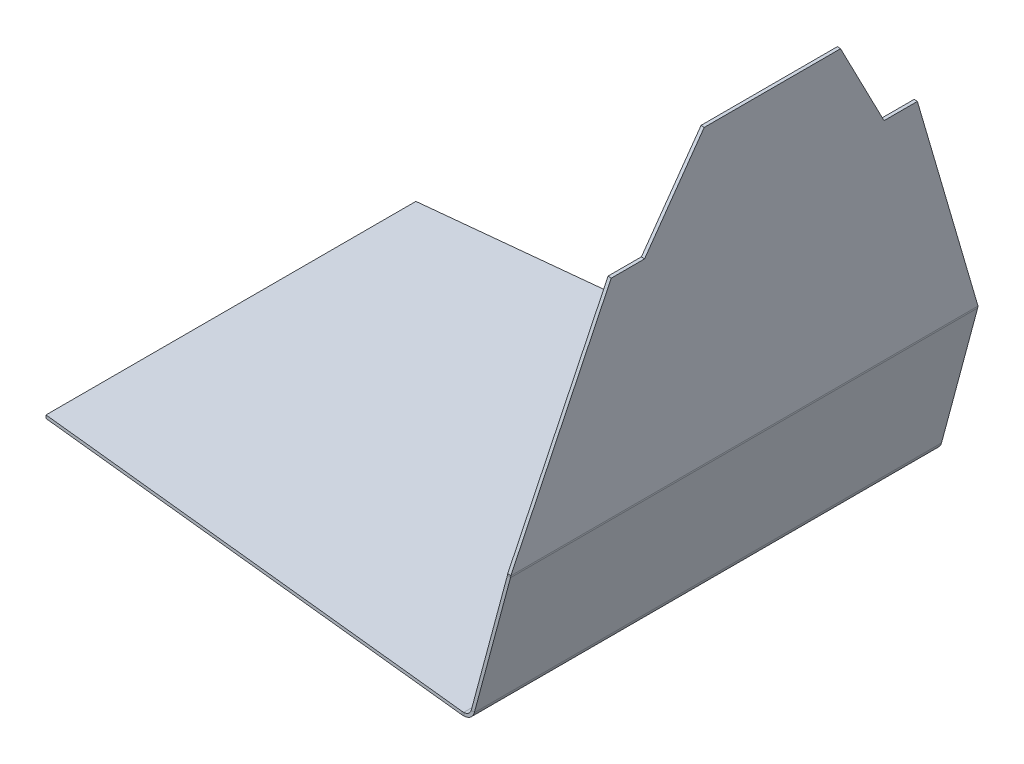
ISO-10303-21;
HEADER;
FILE_DESCRIPTION(('STEP AP214'),'2;1');
FILE_NAME('part.step','',(''),(''),'','','');
FILE_SCHEMA(('AUTOMOTIVE_DESIGN { 1 0 10303 214 1 1 1 1 }'));
ENDSEC;
DATA;
#1=APPLICATION_CONTEXT('core data for automotive mechanical design processes');
#2=APPLICATION_PROTOCOL_DEFINITION('international standard','automotive_design',2000,#1);
#3=PRODUCT_CONTEXT('',#1,'mechanical');
#4=PRODUCT('Part','Part','',(#3));
#5=PRODUCT_RELATED_PRODUCT_CATEGORY('part','',(#4));
#6=PRODUCT_DEFINITION_FORMATION('','',#4);
#7=PRODUCT_DEFINITION_CONTEXT('part definition',#1,'design');
#8=PRODUCT_DEFINITION('design','',#6,#7);
#9=PRODUCT_DEFINITION_SHAPE('','',#8);
#10=(LENGTH_UNIT() NAMED_UNIT(*) SI_UNIT(.MILLI.,.METRE.));
#11=(NAMED_UNIT(*) PLANE_ANGLE_UNIT() SI_UNIT($,.RADIAN.));
#12=(NAMED_UNIT(*) SI_UNIT($,.STERADIAN.) SOLID_ANGLE_UNIT());
#13=UNCERTAINTY_MEASURE_WITH_UNIT(LENGTH_MEASURE(1.E-05),#10,'distance_accuracy_value','');
#14=(GEOMETRIC_REPRESENTATION_CONTEXT(3) GLOBAL_UNCERTAINTY_ASSIGNED_CONTEXT((#13)) GLOBAL_UNIT_ASSIGNED_CONTEXT((#10,
#11,#12)) REPRESENTATION_CONTEXT('',''));
#15=CARTESIAN_POINT('',(0.,0.,0.));
#16=DIRECTION('',(0.,0.,1.));
#17=DIRECTION('',(1.,0.,0.));
#18=AXIS2_PLACEMENT_3D('',#15,#16,#17);
#19=CARTESIAN_POINT('',(446.934065691937,-39.1016640915989,-1.22240307231145E-13));
#20=DIRECTION('',(0.996194698091745,-0.0871557427476666,0.));
#21=DIRECTION('',(0.0871557427476666,0.996194698091745,0.));
#22=AXIS2_PLACEMENT_3D('',#19,#20,#21);
#23=PLANE('',#22);
#24=DIRECTION('',(0.,0.,-1.));
#25=VECTOR('',#24,1.);
#26=CARTESIAN_POINT('',(503.063220608211,602.45751231115,-300.));
#27=LINE('',#26,#25);
#28=CARTESIAN_POINT('',(503.063220608211,602.45751231115,87.5516477613444));
#29=VERTEX_POINT('',#28);
#30=CARTESIAN_POINT('',(503.063220608211,602.45751231115,-87.5516477613445));
#31=VERTEX_POINT('',#30);
#32=EDGE_CURVE('E209',#29,#31,#27,.T.);
#33=ORIENTED_EDGE('',*,*,#32,.F.);
#34=DIRECTION('',(-0.076110943801157,-0.869952068459671,0.487227383073281));
#35=VECTOR('',#34,1.);
#36=CARTESIAN_POINT('',(463.505302291546,150.308436963351,340.783312732004));
#37=LINE('',#36,#35);
#38=CARTESIAN_POINT('',(492.714619418007,484.172459446715,153.79865015754));
#39=VERTEX_POINT('',#38);
#40=EDGE_CURVE('E194',#29,#39,#37,.T.);
#41=ORIENTED_EDGE('',*,*,#40,.T.);
#42=DIRECTION('',(0.,0.,1.));
#43=VECTOR('',#42,1.);
#44=CARTESIAN_POINT('',(492.714619418008,484.172459446715,-1.81627154925868E-13));
#45=LINE('',#44,#43);
#46=CARTESIAN_POINT('',(492.714619418008,484.172459446715,196.591479546335));
#47=VERTEX_POINT('',#46);
#48=EDGE_CURVE('E393',#39,#47,#45,.T.);
#49=ORIENTED_EDGE('',*,*,#48,.T.);
#50=DIRECTION('',(-0.0821947035906193,-0.939489761050654,0.332570322762923));
#51=VECTOR('',#50,1.);
#52=CARTESIAN_POINT('',(457.37146331674,80.198336664604,339.594426434514));
#53=LINE('',#52,#51);
#54=CARTESIAN_POINT('',(467.157219657198,192.050043458108,300.));
#55=VERTEX_POINT('',#54);
#56=EDGE_CURVE('E396',#47,#55,#53,.T.);
#57=ORIENTED_EDGE('',*,*,#56,.T.);
#58=DIRECTION('',(0.,0.,-1.));
#59=VECTOR('',#58,1.);
#60=CARTESIAN_POINT('',(467.157219657198,192.050043458108,-2.5616833397339E-13));
#61=LINE('',#60,#59);
#62=CARTESIAN_POINT('',(467.157219657198,192.050043458108,-300.));
#63=VERTEX_POINT('',#62);
#64=EDGE_CURVE('E210',#55,#63,#61,.T.);
#65=ORIENTED_EDGE('',*,*,#64,.T.);
#66=DIRECTION('',(0.0821947035906195,0.939489761050654,0.332570322762923));
#67=VECTOR('',#66,1.);
#68=CARTESIAN_POINT('',(457.37146331674,80.1983366646043,-339.594426434515));
#69=LINE('',#68,#67);
#70=CARTESIAN_POINT('',(492.714619418007,484.172459446715,-196.591479546335));
#71=VERTEX_POINT('',#70);
#72=EDGE_CURVE('E374',#63,#71,#69,.T.);
#73=ORIENTED_EDGE('',*,*,#72,.T.);
#74=DIRECTION('',(0.,0.,1.));
#75=VECTOR('',#74,1.);
#76=CARTESIAN_POINT('',(492.714619418008,484.172459446715,-1.22240307231145E-13));
#77=LINE('',#76,#75);
#78=CARTESIAN_POINT('',(492.714619418008,484.172459446715,-153.79865015754));
#79=VERTEX_POINT('',#78);
#80=EDGE_CURVE('E378',#71,#79,#77,.T.);
#81=ORIENTED_EDGE('',*,*,#80,.T.);
#82=DIRECTION('',(0.0761109438011572,0.86995206845967,0.487227383073282));
#83=VECTOR('',#82,1.);
#84=CARTESIAN_POINT('',(463.505302291546,150.308436963352,-340.783312732004));
#85=LINE('',#84,#83);
#86=EDGE_CURVE('E381',#79,#31,#85,.T.);
#87=ORIENTED_EDGE('',*,*,#86,.T.);
#88=EDGE_LOOP('',(#33,#41,#49,#57,#65,#73,#81,#87));
#89=FACE_BOUND('',#88,.T.);
#90=ADVANCED_FACE('F59',(#89),#23,.T.);
#91=CARTESIAN_POINT('',(442.94928689957,-38.7530411206082,-1.21150435992368E-13));
#92=DIRECTION('',(0.996194698091745,-0.0871557427476666,0.));
#93=DIRECTION('',(0.0871557427476666,0.996194698091745,0.));
#94=AXIS2_PLACEMENT_3D('',#91,#92,#93);
#95=PLANE('',#94);
#96=DIRECTION('',(-0.076110943801157,-0.869952068459671,0.487227383073281));
#97=VECTOR('',#96,1.);
#98=CARTESIAN_POINT('',(459.520523499179,150.657059934342,340.783312732004));
#99=LINE('',#98,#97);
#100=CARTESIAN_POINT('',(499.078441815844,602.806135282141,87.5516477613445));
#101=VERTEX_POINT('',#100);
#102=CARTESIAN_POINT('',(488.729840625641,484.521082417706,153.79865015754));
#103=VERTEX_POINT('',#102);
#104=EDGE_CURVE('E191',#101,#103,#99,.T.);
#105=ORIENTED_EDGE('',*,*,#104,.F.);
#106=DIRECTION('',(0.,0.,-1.));
#107=VECTOR('',#106,1.);
#108=CARTESIAN_POINT('',(499.078441815844,602.80613528214,-300.));
#109=LINE('',#108,#107);
#110=CARTESIAN_POINT('',(499.078441815844,602.80613528214,-87.5516477613445));
#111=VERTEX_POINT('',#110);
#112=EDGE_CURVE('E75',#101,#111,#109,.T.);
#113=ORIENTED_EDGE('',*,*,#112,.T.);
#114=DIRECTION('',(0.0761109438011572,0.86995206845967,0.487227383073282));
#115=VECTOR('',#114,1.);
#116=CARTESIAN_POINT('',(459.520523499179,150.657059934342,-340.783312732004));
#117=LINE('',#116,#115);
#118=CARTESIAN_POINT('',(488.729840625641,484.521082417706,-153.79865015754));
#119=VERTEX_POINT('',#118);
#120=EDGE_CURVE('E377',#119,#111,#117,.T.);
#121=ORIENTED_EDGE('',*,*,#120,.F.);
#122=DIRECTION('',(0.,0.,1.));
#123=VECTOR('',#122,1.);
#124=CARTESIAN_POINT('',(488.729840625641,484.521082417706,-1.21150435992368E-13));
#125=LINE('',#124,#123);
#126=CARTESIAN_POINT('',(488.729840625641,484.521082417706,-196.591479546335));
#127=VERTEX_POINT('',#126);
#128=EDGE_CURVE('E384',#127,#119,#125,.T.);
#129=ORIENTED_EDGE('',*,*,#128,.F.);
#130=DIRECTION('',(0.0821947035906195,0.939489761050654,0.332570322762923));
#131=VECTOR('',#130,1.);
#132=CARTESIAN_POINT('',(453.386684524373,80.5469596355949,-339.594426434515));
#133=LINE('',#132,#131);
#134=CARTESIAN_POINT('',(463.172440864831,192.398666429099,-300.));
#135=VERTEX_POINT('',#134);
#136=EDGE_CURVE('E370',#135,#127,#133,.T.);
#137=ORIENTED_EDGE('',*,*,#136,.F.);
#138=DIRECTION('',(0.,0.,-1.));
#139=VECTOR('',#138,1.);
#140=CARTESIAN_POINT('',(463.172440864831,192.398666429099,300.));
#141=LINE('',#140,#139);
#142=CARTESIAN_POINT('',(463.172440864831,192.398666429099,300.));
#143=VERTEX_POINT('',#142);
#144=EDGE_CURVE('E359',#143,#135,#141,.T.);
#145=ORIENTED_EDGE('',*,*,#144,.F.);
#146=DIRECTION('',(-0.0821947035906193,-0.939489761050654,0.332570322762923));
#147=VECTOR('',#146,1.);
#148=CARTESIAN_POINT('',(453.386684524373,80.5469596355947,339.594426434514));
#149=LINE('',#148,#147);
#150=CARTESIAN_POINT('',(488.729840625641,484.521082417706,196.591479546335));
#151=VERTEX_POINT('',#150);
#152=EDGE_CURVE('E392',#151,#143,#149,.T.);
#153=ORIENTED_EDGE('',*,*,#152,.F.);
#154=DIRECTION('',(0.,0.,1.));
#155=VECTOR('',#154,1.);
#156=CARTESIAN_POINT('',(488.729840625641,484.521082417706,-1.21150435992368E-13));
#157=LINE('',#156,#155);
#158=EDGE_CURVE('E203',#103,#151,#157,.T.);
#159=ORIENTED_EDGE('',*,*,#158,.F.);
#160=EDGE_LOOP('',(#105,#113,#121,#129,#137,#145,#153,#159));
#161=FACE_BOUND('',#160,.T.);
#162=ADVANCED_FACE('F201',(#161),#95,.F.);
#163=CARTESIAN_POINT('',(503.063220608211,602.45751231115,-300.));
#164=DIRECTION('',(0.0871557427476667,0.996194698091745,0.));
#165=DIRECTION('',(-0.996194698091745,0.0871557427476667,0.));
#166=AXIS2_PLACEMENT_3D('',#163,#164,#165);
#167=PLANE('',#166);
#168=ORIENTED_EDGE('',*,*,#112,.F.);
#169=DIRECTION('',(0.996194698091745,-0.0871557427476666,0.));
#170=VECTOR('',#169,1.);
#171=CARTESIAN_POINT('',(503.063220608211,602.45751231115,87.5516477613444));
#172=LINE('',#171,#170);
#173=EDGE_CURVE('E188',#29,#101,#172,.F.);
#174=ORIENTED_EDGE('',*,*,#173,.F.);
#175=ORIENTED_EDGE('',*,*,#32,.T.);
#176=DIRECTION('',(0.996194698091745,-0.0871557427476666,0.));
#177=VECTOR('',#176,1.);
#178=CARTESIAN_POINT('',(503.063220608211,602.45751231115,-87.5516477613445));
#179=LINE('',#178,#177);
#180=EDGE_CURVE('E208',#31,#111,#179,.F.);
#181=ORIENTED_EDGE('',*,*,#180,.T.);
#182=EDGE_LOOP('',(#168,#174,#175,#181));
#183=FACE_BOUND('',#182,.T.);
#184=ADVANCED_FACE('F206',(#183),#167,.T.);
#185=CARTESIAN_POINT('',(466.959892775471,190.491832821212,-300.));
#186=DIRECTION('',(0.,0.,1.));
#187=DIRECTION('',(1.,0.,0.));
#188=AXIS2_PLACEMENT_3D('',#185,#186,#187);
#189=PLANE('',#188);
#190=DIRECTION('',(0.965925826289072,-0.258819045102507,0.));
#191=VECTOR('',#190,1.);
#192=CARTESIAN_POINT('',(462.869752146806,190.682033405549,-300.));
#193=LINE('',#192,#191);
#194=CARTESIAN_POINT('',(462.869752146804,190.68203340555,-300.));
#195=VERTEX_POINT('',#194);
#196=CARTESIAN_POINT('',(466.733455451962,189.646757225139,-300.));
#197=VERTEX_POINT('',#196);
#198=EDGE_CURVE('E224',#195,#197,#193,.T.);
#199=ORIENTED_EDGE('',*,*,#198,.T.);
#200=DIRECTION('',(0.258819045102524,0.965925826289067,0.));
#201=VECTOR('',#200,1.);
#202=CARTESIAN_POINT('',(388.726426009517,-101.479440001577,-300.));
#203=LINE('',#202,#201);
#204=CARTESIAN_POINT('',(420.30583889723,16.3765333685647,-300.));
#205=VERTEX_POINT('',#204);
#206=EDGE_CURVE('E242',#205,#197,#203,.T.);
#207=ORIENTED_EDGE('',*,*,#206,.F.);
#208=DIRECTION('',(-0.965925826289068,0.258819045102524,0.));
#209=VECTOR('',#208,1.);
#210=CARTESIAN_POINT('',(416.442135592074,17.4118095489749,-300.));
#211=LINE('',#210,#209);
#212=CARTESIAN_POINT('',(416.442135592074,17.4118095489748,-300.));
#213=VERTEX_POINT('',#212);
#214=EDGE_CURVE('E251',#213,#205,#211,.F.);
#215=ORIENTED_EDGE('',*,*,#214,.F.);
#216=DIRECTION('',(-0.258819045102524,-0.965925826289067,0.));
#217=VECTOR('',#216,1.);
#218=CARTESIAN_POINT('',(463.096189470315,191.527109001622,-300.));
#219=LINE('',#218,#217);
#220=EDGE_CURVE('E246',#213,#195,#219,.F.);
#221=ORIENTED_EDGE('',*,*,#220,.T.);
#222=EDGE_LOOP('',(#199,#207,#215,#221));
#223=FACE_BOUND('',#222,.T.);
#224=ADVANCED_FACE('F346',(#223),#189,.F.);
#225=CARTESIAN_POINT('',(418.319850514129,8.9647238195899,300.));
#226=DIRECTION('',(0.,0.,-1.));
#227=DIRECTION('',(-1.,0.,0.));
#228=AXIS2_PLACEMENT_3D('',#225,#226,#227);
#229=PLANE('',#228);
#230=DIRECTION('',(0.965925826289072,-0.258819045102507,0.));
#231=VECTOR('',#230,1.);
#232=CARTESIAN_POINT('',(462.869752146804,190.68203340555,300.));
#233=LINE('',#232,#231);
#234=CARTESIAN_POINT('',(462.869752146804,190.68203340555,300.));
#235=VERTEX_POINT('',#234);
#236=CARTESIAN_POINT('',(466.73345545196,189.64675722514,300.));
#237=VERTEX_POINT('',#236);
#238=EDGE_CURVE('E233',#235,#237,#233,.T.);
#239=ORIENTED_EDGE('',*,*,#238,.F.);
#240=DIRECTION('',(0.258819045102524,0.965925826289067,0.));
#241=VECTOR('',#240,1.);
#242=CARTESIAN_POINT('',(414.456147208973,9.99999999999998,300.));
#243=LINE('',#242,#241);
#244=CARTESIAN_POINT('',(416.442135592074,17.4118095489747,300.));
#245=VERTEX_POINT('',#244);
#246=EDGE_CURVE('E244',#235,#245,#243,.F.);
#247=ORIENTED_EDGE('',*,*,#246,.T.);
#248=DIRECTION('',(-0.965925826289068,0.258819045102524,0.));
#249=VECTOR('',#248,1.);
#250=CARTESIAN_POINT('',(420.305838897231,16.3765333685647,300.));
#251=LINE('',#250,#249);
#252=CARTESIAN_POINT('',(420.305838897231,16.3765333685646,300.));
#253=VERTEX_POINT('',#252);
#254=EDGE_CURVE('E236',#245,#253,#251,.F.);
#255=ORIENTED_EDGE('',*,*,#254,.T.);
#256=DIRECTION('',(-0.258819045102524,-0.965925826289067,0.));
#257=VECTOR('',#256,1.);
#258=CARTESIAN_POINT('',(388.726426009517,-101.479440001577,300.));
#259=LINE('',#258,#257);
#260=EDGE_CURVE('E239',#237,#253,#259,.T.);
#261=ORIENTED_EDGE('',*,*,#260,.F.);
#262=EDGE_LOOP('',(#239,#247,#255,#261));
#263=FACE_BOUND('',#262,.T.);
#264=ADVANCED_FACE('F449',(#263),#229,.F.);
#265=CARTESIAN_POINT('',(388.726426009517,-101.479440001577,-1.10216495095742E-13));
#266=DIRECTION('',(-0.965925826289068,0.258819045102524,0.));
#267=DIRECTION('',(-0.258819045102524,-0.965925826289067,0.));
#268=AXIS2_PLACEMENT_3D('',#265,#266,#267);
#269=PLANE('',#268);
#270=DIRECTION('',(0.,0.,-1.));
#271=VECTOR('',#270,1.);
#272=CARTESIAN_POINT('',(466.733455451962,189.646757225139,-300.));
#273=LINE('',#272,#271);
#274=EDGE_CURVE('E218',#197,#237,#273,.F.);
#275=ORIENTED_EDGE('',*,*,#274,.T.);
#276=ORIENTED_EDGE('',*,*,#260,.T.);
#277=DIRECTION('',(0.,0.,-1.));
#278=VECTOR('',#277,1.);
#279=CARTESIAN_POINT('',(420.305838897231,16.3765333685646,300.));
#280=LINE('',#279,#278);
#281=EDGE_CURVE('E248',#205,#253,#280,.F.);
#282=ORIENTED_EDGE('',*,*,#281,.F.);
#283=ORIENTED_EDGE('',*,*,#206,.T.);
#284=EDGE_LOOP('',(#275,#276,#282,#283));
#285=FACE_BOUND('',#284,.T.);
#286=ADVANCED_FACE('F446',(#285),#269,.F.);
#287=CARTESIAN_POINT('',(384.86272270436,-100.444163821167,-1.09144102003316E-13));
#288=DIRECTION('',(-0.965925826289068,0.258819045102524,0.));
#289=DIRECTION('',(-0.258819045102524,-0.965925826289067,0.));
#290=AXIS2_PLACEMENT_3D('',#287,#288,#289);
#291=PLANE('',#290);
#292=ORIENTED_EDGE('',*,*,#246,.F.);
#293=DIRECTION('',(0.,0.,-1.));
#294=VECTOR('',#293,1.);
#295=CARTESIAN_POINT('',(462.869752146806,190.682033405549,-300.));
#296=LINE('',#295,#294);
#297=EDGE_CURVE('E83',#195,#235,#296,.F.);
#298=ORIENTED_EDGE('',*,*,#297,.F.);
#299=ORIENTED_EDGE('',*,*,#220,.F.);
#300=DIRECTION('',(0.,0.,-1.));
#301=VECTOR('',#300,1.);
#302=CARTESIAN_POINT('',(416.442135592074,17.4118095489747,300.));
#303=LINE('',#302,#301);
#304=EDGE_CURVE('E254',#245,#213,#303,.T.);
#305=ORIENTED_EDGE('',*,*,#304,.F.);
#306=EDGE_LOOP('',(#292,#298,#299,#305));
#307=FACE_BOUND('',#306,.T.);
#308=ADVANCED_FACE('F342',(#307),#291,.T.);
#309=CARTESIAN_POINT('',(-192.279765905027,10.,-237.5));
#310=DIRECTION('',(0.104166666666667,0.,0.994559855190001));
#311=DIRECTION('',(-0.994559855190001,0.,0.104166666666667));
#312=AXIS2_PLACEMENT_3D('',#309,#310,#311);
#313=PLANE('',#312);
#314=DIRECTION('',(0.,1.,0.));
#315=VECTOR('',#314,1.);
#316=CARTESIAN_POINT('',(404.456147208973,10.,-300.));
#317=LINE('',#316,#315);
#318=CARTESIAN_POINT('',(404.456147208973,6.00000000000001,-300.));
#319=VERTEX_POINT('',#318);
#320=CARTESIAN_POINT('',(404.456147208973,10.,-300.));
#321=VERTEX_POINT('',#320);
#322=EDGE_CURVE('E68',#319,#321,#317,.T.);
#323=ORIENTED_EDGE('',*,*,#322,.F.);
#324=DIRECTION('',(-0.994559855190001,0.,0.104166666666667));
#325=VECTOR('',#324,1.);
#326=CARTESIAN_POINT('',(-192.279765905027,6.,-237.5));
#327=LINE('',#326,#325);
#328=CARTESIAN_POINT('',(-192.279765905027,6.,-237.5));
#329=VERTEX_POINT('',#328);
#330=EDGE_CURVE('E294',#319,#329,#327,.T.);
#331=ORIENTED_EDGE('',*,*,#330,.T.);
#332=DIRECTION('',(0.,1.,0.));
#333=VECTOR('',#332,1.);
#334=CARTESIAN_POINT('',(-192.279765905027,10.,-237.5));
#335=LINE('',#334,#333);
#336=CARTESIAN_POINT('',(-192.279765905027,10.,-237.5));
#337=VERTEX_POINT('',#336);
#338=EDGE_CURVE('E307',#329,#337,#335,.T.);
#339=ORIENTED_EDGE('',*,*,#338,.T.);
#340=DIRECTION('',(-0.994559855190001,0.,0.104166666666667));
#341=VECTOR('',#340,1.);
#342=CARTESIAN_POINT('',(-192.279765905027,10.,-237.5));
#343=LINE('',#342,#341);
#344=EDGE_CURVE('E297',#321,#337,#343,.T.);
#345=ORIENTED_EDGE('',*,*,#344,.F.);
#346=EDGE_LOOP('',(#323,#331,#339,#345));
#347=FACE_BOUND('',#346,.T.);
#348=ADVANCED_FACE('F321',(#347),#313,.F.);
#349=CARTESIAN_POINT('',(-192.279765905027,10.,237.5));
#350=DIRECTION('',(1.,0.,0.));
#351=DIRECTION('',(0.,0.,1.));
#352=AXIS2_PLACEMENT_3D('',#349,#350,#351);
#353=PLANE('',#352);
#354=ORIENTED_EDGE('',*,*,#338,.F.);
#355=DIRECTION('',(0.,0.,-1.));
#356=VECTOR('',#355,1.);
#357=CARTESIAN_POINT('',(-192.279765905027,6.,0.));
#358=LINE('',#357,#356);
#359=CARTESIAN_POINT('',(-192.279765905027,6.,237.5));
#360=VERTEX_POINT('',#359);
#361=EDGE_CURVE('E288',#329,#360,#358,.F.);
#362=ORIENTED_EDGE('',*,*,#361,.T.);
#363=DIRECTION('',(0.,1.,0.));
#364=VECTOR('',#363,1.);
#365=CARTESIAN_POINT('',(-192.279765905027,10.,237.5));
#366=LINE('',#365,#364);
#367=CARTESIAN_POINT('',(-192.279765905027,10.,237.5));
#368=VERTEX_POINT('',#367);
#369=EDGE_CURVE('E63',#360,#368,#366,.T.);
#370=ORIENTED_EDGE('',*,*,#369,.T.);
#371=DIRECTION('',(0.,0.,1.));
#372=VECTOR('',#371,1.);
#373=CARTESIAN_POINT('',(-192.279765905027,10.,237.5));
#374=LINE('',#373,#372);
#375=EDGE_CURVE('E290',#337,#368,#374,.T.);
#376=ORIENTED_EDGE('',*,*,#375,.F.);
#377=EDGE_LOOP('',(#354,#362,#370,#376));
#378=FACE_BOUND('',#377,.T.);
#379=ADVANCED_FACE('F325',(#378),#353,.F.);
#380=CARTESIAN_POINT('',(404.456147208973,10.,300.));
#381=DIRECTION('',(0.104166666666667,0.,-0.994559855190001));
#382=DIRECTION('',(0.994559855190001,0.,0.104166666666667));
#383=AXIS2_PLACEMENT_3D('',#380,#381,#382);
#384=PLANE('',#383);
#385=DIRECTION('',(0.994559855190001,0.,0.104166666666667));
#386=VECTOR('',#385,1.);
#387=CARTESIAN_POINT('',(404.456147208973,6.,300.));
#388=LINE('',#387,#386);
#389=CARTESIAN_POINT('',(404.456147208973,5.99999999999991,300.));
#390=VERTEX_POINT('',#389);
#391=EDGE_CURVE('E302',#360,#390,#388,.T.);
#392=ORIENTED_EDGE('',*,*,#391,.T.);
#393=DIRECTION('',(0.,1.,0.));
#394=VECTOR('',#393,1.);
#395=CARTESIAN_POINT('',(404.456147208973,10.,300.));
#396=LINE('',#395,#394);
#397=CARTESIAN_POINT('',(404.456147208973,9.99999999999991,300.));
#398=VERTEX_POINT('',#397);
#399=EDGE_CURVE('E13',#390,#398,#396,.T.);
#400=ORIENTED_EDGE('',*,*,#399,.T.);
#401=DIRECTION('',(0.994559855190001,0.,0.104166666666667));
#402=VECTOR('',#401,1.);
#403=CARTESIAN_POINT('',(404.456147208973,10.,300.));
#404=LINE('',#403,#402);
#405=EDGE_CURVE('E293',#368,#398,#404,.T.);
#406=ORIENTED_EDGE('',*,*,#405,.F.);
#407=ORIENTED_EDGE('',*,*,#369,.F.);
#408=EDGE_LOOP('',(#392,#400,#406,#407));
#409=FACE_BOUND('',#408,.T.);
#410=ADVANCED_FACE('F61',(#409),#384,.F.);
#411=CARTESIAN_POINT('',(0.,10.,0.));
#412=DIRECTION('',(0.,-1.,0.));
#413=DIRECTION('',(0.,0.,-1.));
#414=AXIS2_PLACEMENT_3D('',#411,#412,#413);
#415=PLANE('',#414);
#416=ORIENTED_EDGE('',*,*,#375,.T.);
#417=ORIENTED_EDGE('',*,*,#405,.T.);
#418=DIRECTION('',(-1.,0.,0.));
#419=VECTOR('',#418,1.);
#420=CARTESIAN_POINT('',(406.782877329183,9.9999999999999,300.));
#421=LINE('',#420,#419);
#422=CARTESIAN_POINT('',(406.782877329183,9.9999999999999,300.));
#423=VERTEX_POINT('',#422);
#424=EDGE_CURVE('E278',#423,#398,#421,.T.);
#425=ORIENTED_EDGE('',*,*,#424,.F.);
#426=DIRECTION('',(0.,0.,-1.));
#427=VECTOR('',#426,1.);
#428=CARTESIAN_POINT('',(406.782877329183,10.,-300.));
#429=LINE('',#428,#427);
#430=CARTESIAN_POINT('',(406.782877329183,10.,-300.));
#431=VERTEX_POINT('',#430);
#432=EDGE_CURVE('E271',#431,#423,#429,.F.);
#433=ORIENTED_EDGE('',*,*,#432,.F.);
#434=DIRECTION('',(-1.,0.,0.));
#435=VECTOR('',#434,1.);
#436=CARTESIAN_POINT('',(406.782877329183,10.,-300.));
#437=LINE('',#436,#435);
#438=EDGE_CURVE('E285',#431,#321,#437,.T.);
#439=ORIENTED_EDGE('',*,*,#438,.T.);
#440=ORIENTED_EDGE('',*,*,#344,.T.);
#441=EDGE_LOOP('',(#416,#417,#425,#433,#439,#440));
#442=FACE_BOUND('',#441,.T.);
#443=ADVANCED_FACE('F319',(#442),#415,.F.);
#444=CARTESIAN_POINT('',(0.,6.,0.));
#445=DIRECTION('',(0.,-1.,0.));
#446=DIRECTION('',(0.,0.,-1.));
#447=AXIS2_PLACEMENT_3D('',#444,#445,#446);
#448=PLANE('',#447);
#449=ORIENTED_EDGE('',*,*,#361,.F.);
#450=ORIENTED_EDGE('',*,*,#330,.F.);
#451=DIRECTION('',(-1.,0.,0.));
#452=VECTOR('',#451,1.);
#453=CARTESIAN_POINT('',(406.782877329183,6.,-300.));
#454=LINE('',#453,#452);
#455=CARTESIAN_POINT('',(406.782877329183,6.,-300.));
#456=VERTEX_POINT('',#455);
#457=EDGE_CURVE('E283',#456,#319,#454,.T.);
#458=ORIENTED_EDGE('',*,*,#457,.F.);
#459=DIRECTION('',(0.,0.,-1.));
#460=VECTOR('',#459,1.);
#461=CARTESIAN_POINT('',(406.782877329183,6.,-300.));
#462=LINE('',#461,#460);
#463=CARTESIAN_POINT('',(406.782877329183,5.9999999999999,300.));
#464=VERTEX_POINT('',#463);
#465=EDGE_CURVE('E258',#456,#464,#462,.F.);
#466=ORIENTED_EDGE('',*,*,#465,.T.);
#467=DIRECTION('',(-1.,0.,0.));
#468=VECTOR('',#467,1.);
#469=CARTESIAN_POINT('',(406.782877329183,5.9999999999999,300.));
#470=LINE('',#469,#468);
#471=EDGE_CURVE('E281',#464,#390,#470,.T.);
#472=ORIENTED_EDGE('',*,*,#471,.T.);
#473=ORIENTED_EDGE('',*,*,#391,.F.);
#474=EDGE_LOOP('',(#449,#450,#458,#466,#472,#473));
#475=FACE_BOUND('',#474,.T.);
#476=ADVANCED_FACE('F474',(#475),#448,.T.);
#477=CARTESIAN_POINT('',(406.782877329183,10.,-300.));
#478=DIRECTION('',(0.,0.,-1.));
#479=DIRECTION('',(0.,-1.,0.));
#480=AXIS2_PLACEMENT_3D('',#477,#478,#479);
#481=PLANE('',#480);
#482=ORIENTED_EDGE('',*,*,#438,.F.);
#483=DIRECTION('',(0.,-1.,0.));
#484=VECTOR('',#483,1.);
#485=CARTESIAN_POINT('',(406.782877329183,10.,-300.));
#486=LINE('',#485,#484);
#487=EDGE_CURVE('E265',#431,#456,#486,.T.);
#488=ORIENTED_EDGE('',*,*,#487,.T.);
#489=ORIENTED_EDGE('',*,*,#457,.T.);
#490=ORIENTED_EDGE('',*,*,#322,.T.);
#491=EDGE_LOOP('',(#482,#488,#489,#490));
#492=FACE_BOUND('',#491,.T.);
#493=ADVANCED_FACE('F312',(#492),#481,.T.);
#494=CARTESIAN_POINT('',(406.782877329183,9.9999999999999,300.));
#495=DIRECTION('',(0.,0.,-1.));
#496=DIRECTION('',(0.,-1.,0.));
#497=AXIS2_PLACEMENT_3D('',#494,#495,#496);
#498=PLANE('',#497);
#499=ORIENTED_EDGE('',*,*,#471,.F.);
#500=DIRECTION('',(0.,-1.,0.));
#501=VECTOR('',#500,1.);
#502=CARTESIAN_POINT('',(406.782877329183,9.9999999999999,300.));
#503=LINE('',#502,#501);
#504=EDGE_CURVE('E275',#423,#464,#503,.T.);
#505=ORIENTED_EDGE('',*,*,#504,.F.);
#506=ORIENTED_EDGE('',*,*,#424,.T.);
#507=ORIENTED_EDGE('',*,*,#399,.F.);
#508=EDGE_LOOP('',(#499,#505,#506,#507));
#509=FACE_BOUND('',#508,.T.);
#510=ADVANCED_FACE('F332',(#509),#498,.F.);
#511=CARTESIAN_POINT('',(406.782877329184,20.,300.));
#512=DIRECTION('',(0.,0.,1.));
#513=DIRECTION('',(0.,-1.,0.));
#514=AXIS2_PLACEMENT_3D('',#511,#512,#513);
#515=PLANE('',#514);
#516=ORIENTED_EDGE('',*,*,#254,.F.);
#517=CARTESIAN_POINT('',(406.782877329184,20.,300.));
#518=DIRECTION('',(0.,0.,-1.));
#519=DIRECTION('',(0.,1.,0.));
#520=AXIS2_PLACEMENT_3D('',#517,#518,#519);
#521=CIRCLE('',#520,10.0000000000001);
#522=EDGE_CURVE('E268',#423,#245,#521,.F.);
#523=ORIENTED_EDGE('',*,*,#522,.F.);
#524=ORIENTED_EDGE('',*,*,#504,.T.);
#525=CARTESIAN_POINT('',(406.782877329184,20.,300.));
#526=DIRECTION('',(0.,0.,-1.));
#527=DIRECTION('',(0.,1.,0.));
#528=AXIS2_PLACEMENT_3D('',#525,#526,#527);
#529=CIRCLE('',#528,14.0000000000001);
#530=EDGE_CURVE('E261',#464,#253,#529,.F.);
#531=ORIENTED_EDGE('',*,*,#530,.T.);
#532=EDGE_LOOP('',(#516,#523,#524,#531));
#533=FACE_BOUND('',#532,.T.);
#534=ADVANCED_FACE('F337',(#533),#515,.T.);
#535=CARTESIAN_POINT('',(406.782877329184,20.0000000000001,-300.));
#536=DIRECTION('',(0.,0.,1.));
#537=DIRECTION('',(0.,-1.,0.));
#538=AXIS2_PLACEMENT_3D('',#535,#536,#537);
#539=PLANE('',#538);
#540=CARTESIAN_POINT('',(406.782877329184,20.0000000000001,-300.));
#541=DIRECTION('',(0.,0.,-1.));
#542=DIRECTION('',(0.,1.,0.));
#543=AXIS2_PLACEMENT_3D('',#540,#541,#542);
#544=CIRCLE('',#543,10.0000000000001);
#545=EDGE_CURVE('E241',#213,#431,#544,.T.);
#546=ORIENTED_EDGE('',*,*,#545,.F.);
#547=ORIENTED_EDGE('',*,*,#214,.T.);
#548=CARTESIAN_POINT('',(406.782877329184,20.0000000000001,-300.));
#549=DIRECTION('',(0.,0.,-1.));
#550=DIRECTION('',(0.,1.,0.));
#551=AXIS2_PLACEMENT_3D('',#548,#549,#550);
#552=CIRCLE('',#551,14.0000000000001);
#553=EDGE_CURVE('E262',#205,#456,#552,.T.);
#554=ORIENTED_EDGE('',*,*,#553,.T.);
#555=ORIENTED_EDGE('',*,*,#487,.F.);
#556=EDGE_LOOP('',(#546,#547,#554,#555));
#557=FACE_BOUND('',#556,.T.);
#558=ADVANCED_FACE('F461',(#557),#539,.F.);
#559=CARTESIAN_POINT('',(406.782877329184,20.0000000000001,-300.));
#560=DIRECTION('',(0.,0.,-1.));
#561=DIRECTION('',(0.965925826289067,-0.258819045102524,0.));
#562=AXIS2_PLACEMENT_3D('',#559,#560,#561);
#563=CYLINDRICAL_SURFACE('',#562,14.0000000000001);
#564=ORIENTED_EDGE('',*,*,#465,.F.);
#565=ORIENTED_EDGE('',*,*,#553,.F.);
#566=ORIENTED_EDGE('',*,*,#281,.T.);
#567=ORIENTED_EDGE('',*,*,#530,.F.);
#568=EDGE_LOOP('',(#564,#565,#566,#567));
#569=FACE_BOUND('',#568,.T.);
#570=ADVANCED_FACE('F458',(#569),#563,.T.);
#571=CARTESIAN_POINT('',(406.782877329184,20.0000000000001,-300.));
#572=DIRECTION('',(0.,0.,-1.));
#573=DIRECTION('',(0.965925826289067,-0.258819045102524,0.));
#574=AXIS2_PLACEMENT_3D('',#571,#572,#573);
#575=CYLINDRICAL_SURFACE('',#574,10.0000000000001);
#576=ORIENTED_EDGE('',*,*,#432,.T.);
#577=ORIENTED_EDGE('',*,*,#522,.T.);
#578=ORIENTED_EDGE('',*,*,#304,.T.);
#579=ORIENTED_EDGE('',*,*,#545,.T.);
#580=EDGE_LOOP('',(#576,#577,#578,#579));
#581=FACE_BOUND('',#580,.T.);
#582=ADVANCED_FACE('F340',(#581),#575,.F.);
#583=CARTESIAN_POINT('',(453.210493883912,193.270223856576,300.));
#584=DIRECTION('',(0.,0.,1.));
#585=DIRECTION('',(1.,0.,0.));
#586=AXIS2_PLACEMENT_3D('',#583,#584,#585);
#587=PLANE('',#586);
#588=DIRECTION('',(0.996194698091745,-0.0871557427476666,0.));
#589=VECTOR('',#588,1.);
#590=CARTESIAN_POINT('',(463.172440864831,192.398666429099,300.));
#591=LINE('',#590,#589);
#592=EDGE_CURVE('E361',#143,#55,#591,.T.);
#593=ORIENTED_EDGE('',*,*,#592,.F.);
#594=CARTESIAN_POINT('',(453.210493883912,193.270223856576,300.));
#595=DIRECTION('',(0.,0.,-1.));
#596=DIRECTION('',(-1.,0.,0.));
#597=AXIS2_PLACEMENT_3D('',#594,#595,#596);
#598=CIRCLE('',#597,10.0000000000016);
#599=EDGE_CURVE('E227',#235,#143,#598,.F.);
#600=ORIENTED_EDGE('',*,*,#599,.F.);
#601=ORIENTED_EDGE('',*,*,#238,.T.);
#602=CARTESIAN_POINT('',(453.210493883912,193.270223856576,300.));
#603=DIRECTION('',(0.,0.,-1.));
#604=DIRECTION('',(-1.,0.,0.));
#605=AXIS2_PLACEMENT_3D('',#602,#603,#604);
#606=CIRCLE('',#605,14.0000000000016);
#607=EDGE_CURVE('E220',#237,#55,#606,.F.);
#608=ORIENTED_EDGE('',*,*,#607,.T.);
#609=EDGE_LOOP('',(#593,#600,#601,#608));
#610=FACE_BOUND('',#609,.T.);
#611=ADVANCED_FACE('F405',(#610),#587,.T.);
#612=CARTESIAN_POINT('',(453.210493883914,193.270223856575,-300.));
#613=DIRECTION('',(0.,0.,1.));
#614=DIRECTION('',(1.,0.,0.));
#615=AXIS2_PLACEMENT_3D('',#612,#613,#614);
#616=PLANE('',#615);
#617=CARTESIAN_POINT('',(453.210493883914,193.270223856575,-300.));
#618=DIRECTION('',(0.,0.,-1.));
#619=DIRECTION('',(-1.,0.,0.));
#620=AXIS2_PLACEMENT_3D('',#617,#618,#619);
#621=CIRCLE('',#620,10.0000000000016);
#622=EDGE_CURVE('E212',#135,#195,#621,.T.);
#623=ORIENTED_EDGE('',*,*,#622,.F.);
#624=DIRECTION('',(0.996194698091745,-0.0871557427476666,0.));
#625=VECTOR('',#624,1.);
#626=CARTESIAN_POINT('',(463.172440864831,192.398666429098,-300.));
#627=LINE('',#626,#625);
#628=EDGE_CURVE('E215',#135,#63,#627,.T.);
#629=ORIENTED_EDGE('',*,*,#628,.T.);
#630=CARTESIAN_POINT('',(453.210493883914,193.270223856575,-300.));
#631=DIRECTION('',(0.,0.,-1.));
#632=DIRECTION('',(-1.,0.,0.));
#633=AXIS2_PLACEMENT_3D('',#630,#631,#632);
#634=CIRCLE('',#633,14.0000000000016);
#635=EDGE_CURVE('E221',#63,#197,#634,.T.);
#636=ORIENTED_EDGE('',*,*,#635,.T.);
#637=ORIENTED_EDGE('',*,*,#198,.F.);
#638=EDGE_LOOP('',(#623,#629,#636,#637));
#639=FACE_BOUND('',#638,.T.);
#640=ADVANCED_FACE('F351',(#639),#616,.F.);
#641=CARTESIAN_POINT('',(453.210493883914,193.270223856575,-300.));
#642=DIRECTION('',(0.,0.,-1.));
#643=DIRECTION('',(0.996194698091745,-0.0871557427476666,0.));
#644=AXIS2_PLACEMENT_3D('',#641,#642,#643);
#645=CYLINDRICAL_SURFACE('',#644,14.0000000000016);
#646=ORIENTED_EDGE('',*,*,#274,.F.);
#647=ORIENTED_EDGE('',*,*,#635,.F.);
#648=ORIENTED_EDGE('',*,*,#64,.F.);
#649=ORIENTED_EDGE('',*,*,#607,.F.);
#650=EDGE_LOOP('',(#646,#647,#648,#649));
#651=FACE_BOUND('',#650,.T.);
#652=ADVANCED_FACE('F409',(#651),#645,.T.);
#653=CARTESIAN_POINT('',(453.210493883914,193.270223856575,-300.));
#654=DIRECTION('',(0.,0.,-1.));
#655=DIRECTION('',(0.996194698091745,-0.0871557427476666,0.));
#656=AXIS2_PLACEMENT_3D('',#653,#654,#655);
#657=CYLINDRICAL_SURFACE('',#656,10.0000000000016);
#658=ORIENTED_EDGE('',*,*,#297,.T.);
#659=ORIENTED_EDGE('',*,*,#599,.T.);
#660=ORIENTED_EDGE('',*,*,#144,.T.);
#661=ORIENTED_EDGE('',*,*,#622,.T.);
#662=EDGE_LOOP('',(#658,#659,#660,#661));
#663=FACE_BOUND('',#662,.T.);
#664=ADVANCED_FACE('F356',(#663),#657,.F.);
#665=CARTESIAN_POINT('',(457.37146331674,80.1983366646043,-339.594426434515));
#666=DIRECTION('',(0.0289854134962335,0.331304792279084,-0.943078459311507));
#667=DIRECTION('',(0.0821947035906195,0.939489761050654,0.332570322762923));
#668=AXIS2_PLACEMENT_3D('',#665,#666,#667);
#669=PLANE('',#668);
#670=DIRECTION('',(0.996194698091745,-0.0871557427476666,0.));
#671=VECTOR('',#670,1.);
#672=CARTESIAN_POINT('',(492.714619418007,484.172459446715,-196.591479546335));
#673=LINE('',#672,#671);
#674=EDGE_CURVE('E364',#71,#127,#673,.F.);
#675=ORIENTED_EDGE('',*,*,#674,.F.);
#676=ORIENTED_EDGE('',*,*,#72,.F.);
#677=ORIENTED_EDGE('',*,*,#628,.F.);
#678=ORIENTED_EDGE('',*,*,#136,.T.);
#679=EDGE_LOOP('',(#675,#676,#677,#678));
#680=FACE_BOUND('',#679,.T.);
#681=ADVANCED_FACE('F421',(#680),#669,.T.);
#682=CARTESIAN_POINT('',(463.505302291546,150.308436963352,-340.783312732004));
#683=DIRECTION('',(0.0424646644587535,0.485373335782719,-0.873275144031686));
#684=DIRECTION('',(0.0761109438011572,0.86995206845967,0.487227383073282));
#685=AXIS2_PLACEMENT_3D('',#682,#683,#684);
#686=PLANE('',#685);
#687=ORIENTED_EDGE('',*,*,#180,.F.);
#688=ORIENTED_EDGE('',*,*,#86,.F.);
#689=DIRECTION('',(0.996194698091745,-0.0871557427476666,0.));
#690=VECTOR('',#689,1.);
#691=CARTESIAN_POINT('',(492.714619418008,484.172459446715,-153.79865015754));
#692=LINE('',#691,#690);
#693=EDGE_CURVE('E367',#79,#119,#692,.F.);
#694=ORIENTED_EDGE('',*,*,#693,.T.);
#695=ORIENTED_EDGE('',*,*,#120,.T.);
#696=EDGE_LOOP('',(#687,#688,#694,#695));
#697=FACE_BOUND('',#696,.T.);
#698=ADVANCED_FACE('F414',(#697),#686,.T.);
#699=CARTESIAN_POINT('',(492.714619418008,484.172459446715,-1.22240307231145E-13));
#700=DIRECTION('',(0.0871557427476666,0.996194698091745,0.));
#701=DIRECTION('',(0.,0.,1.));
#702=AXIS2_PLACEMENT_3D('',#699,#700,#701);
#703=PLANE('',#702);
#704=ORIENTED_EDGE('',*,*,#80,.F.);
#705=ORIENTED_EDGE('',*,*,#674,.T.);
#706=ORIENTED_EDGE('',*,*,#128,.T.);
#707=ORIENTED_EDGE('',*,*,#693,.F.);
#708=EDGE_LOOP('',(#704,#705,#706,#707));
#709=FACE_BOUND('',#708,.T.);
#710=ADVANCED_FACE('F418',(#709),#703,.T.);
#711=CARTESIAN_POINT('',(463.505302291546,150.308436963351,340.783312732004));
#712=DIRECTION('',(0.0424646644587539,0.485373335782718,0.873275144031686));
#713=DIRECTION('',(-0.076110943801157,-0.869952068459671,0.487227383073281));
#714=AXIS2_PLACEMENT_3D('',#711,#712,#713);
#715=PLANE('',#714);
#716=DIRECTION('',(0.996194698091745,-0.0871557427476666,0.));
#717=VECTOR('',#716,1.);
#718=CARTESIAN_POINT('',(492.714619418007,484.172459446715,153.79865015754));
#719=LINE('',#718,#717);
#720=EDGE_CURVE('E197',#39,#103,#719,.F.);
#721=ORIENTED_EDGE('',*,*,#720,.F.);
#722=ORIENTED_EDGE('',*,*,#40,.F.);
#723=ORIENTED_EDGE('',*,*,#173,.T.);
#724=ORIENTED_EDGE('',*,*,#104,.T.);
#725=EDGE_LOOP('',(#721,#722,#723,#724));
#726=FACE_BOUND('',#725,.T.);
#727=ADVANCED_FACE('F190',(#726),#715,.T.);
#728=CARTESIAN_POINT('',(457.37146331674,80.198336664604,339.594426434514));
#729=DIRECTION('',(0.028985413496234,0.331304792279084,0.943078459311507));
#730=DIRECTION('',(-0.0821947035906193,-0.939489761050654,0.332570322762923));
#731=AXIS2_PLACEMENT_3D('',#728,#729,#730);
#732=PLANE('',#731);
#733=ORIENTED_EDGE('',*,*,#592,.T.);
#734=ORIENTED_EDGE('',*,*,#56,.F.);
#735=DIRECTION('',(0.996194698091745,-0.0871557427476666,0.));
#736=VECTOR('',#735,1.);
#737=CARTESIAN_POINT('',(492.714619418008,484.172459446715,196.591479546335));
#738=LINE('',#737,#736);
#739=EDGE_CURVE('E198',#47,#151,#738,.F.);
#740=ORIENTED_EDGE('',*,*,#739,.T.);
#741=ORIENTED_EDGE('',*,*,#152,.T.);
#742=EDGE_LOOP('',(#733,#734,#740,#741));
#743=FACE_BOUND('',#742,.T.);
#744=ADVANCED_FACE('F402',(#743),#732,.T.);
#745=CARTESIAN_POINT('',(492.714619418008,484.172459446715,-1.81627154925868E-13));
#746=DIRECTION('',(0.0871557427476666,0.996194698091745,0.));
#747=DIRECTION('',(0.,0.,1.));
#748=AXIS2_PLACEMENT_3D('',#745,#746,#747);
#749=PLANE('',#748);
#750=ORIENTED_EDGE('',*,*,#48,.F.);
#751=ORIENTED_EDGE('',*,*,#720,.T.);
#752=ORIENTED_EDGE('',*,*,#158,.T.);
#753=ORIENTED_EDGE('',*,*,#739,.F.);
#754=EDGE_LOOP('',(#750,#751,#752,#753));
#755=FACE_BOUND('',#754,.T.);
#756=ADVANCED_FACE('F412',(#755),#749,.T.);
#757=CLOSED_SHELL('',(#90,#162,#184,#224,#264,#286,#308,#348,#379,#410,#443,#476,#493,#510,#534,
#558,#570,#582,#611,#640,#652,#664,#681,#698,#710,#727,#744,#756));
#758=MANIFOLD_SOLID_BREP('B2',#757);
#759=ADVANCED_BREP_SHAPE_REPRESENTATION('',(#18,#758),#14);
#760=SHAPE_DEFINITION_REPRESENTATION(#9,#759);
ENDSEC;
END-ISO-10303-21;
